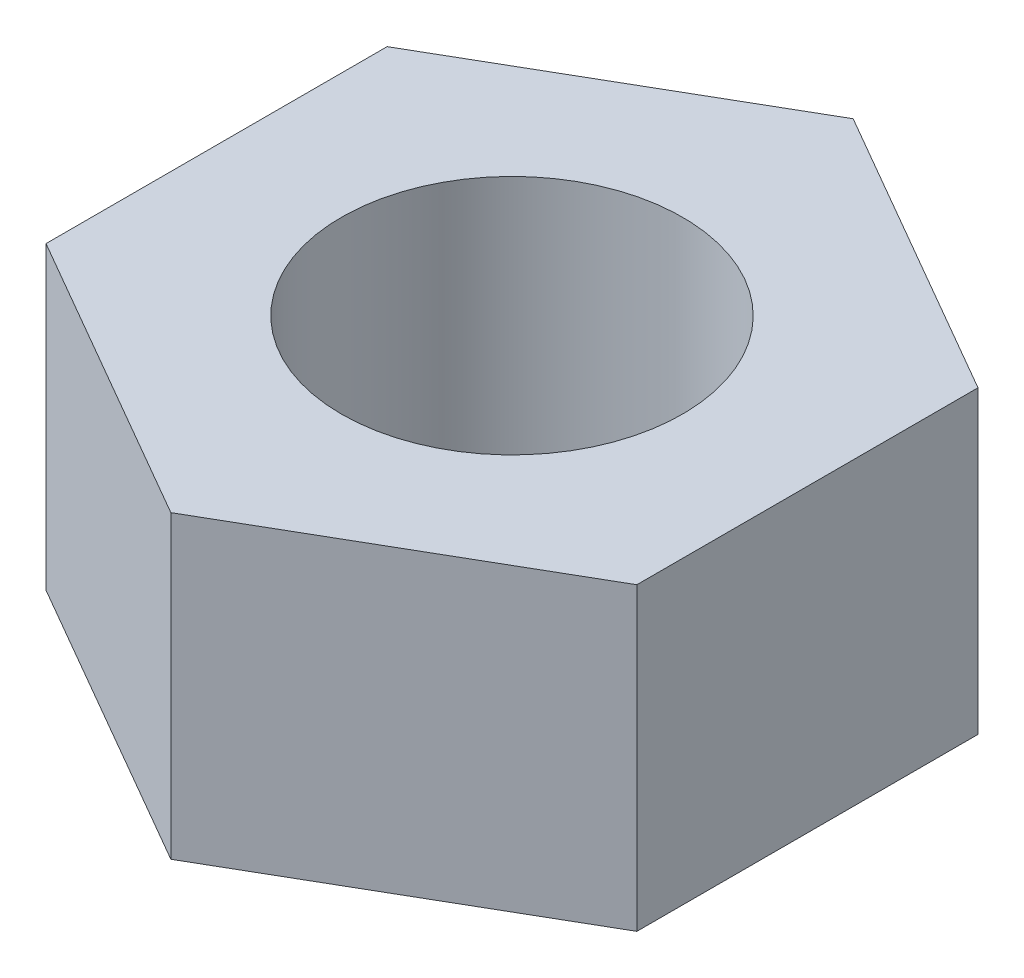
ISO-10303-21;
HEADER;
FILE_DESCRIPTION(('STEP AP214'),'2;1');
FILE_NAME('part.step','',(''),(''),'','','');
FILE_SCHEMA(('AUTOMOTIVE_DESIGN { 1 0 10303 214 1 1 1 1 }'));
ENDSEC;
DATA;
#1=APPLICATION_CONTEXT('core data for automotive mechanical design processes');
#2=APPLICATION_PROTOCOL_DEFINITION('international standard','automotive_design',2000,#1);
#3=PRODUCT_CONTEXT('',#1,'mechanical');
#4=PRODUCT('Part','Part','',(#3));
#5=PRODUCT_RELATED_PRODUCT_CATEGORY('part','',(#4));
#6=PRODUCT_DEFINITION_FORMATION('','',#4);
#7=PRODUCT_DEFINITION_CONTEXT('part definition',#1,'design');
#8=PRODUCT_DEFINITION('design','',#6,#7);
#9=PRODUCT_DEFINITION_SHAPE('','',#8);
#10=(LENGTH_UNIT() NAMED_UNIT(*) SI_UNIT(.MILLI.,.METRE.));
#11=(NAMED_UNIT(*) PLANE_ANGLE_UNIT() SI_UNIT($,.RADIAN.));
#12=(NAMED_UNIT(*) SI_UNIT($,.STERADIAN.) SOLID_ANGLE_UNIT());
#13=UNCERTAINTY_MEASURE_WITH_UNIT(LENGTH_MEASURE(1.E-05),#10,'distance_accuracy_value','');
#14=(GEOMETRIC_REPRESENTATION_CONTEXT(3) GLOBAL_UNCERTAINTY_ASSIGNED_CONTEXT((#13)) GLOBAL_UNIT_ASSIGNED_CONTEXT((#10,
#11,#12)) REPRESENTATION_CONTEXT('',''));
#15=CARTESIAN_POINT('',(0.,0.,0.));
#16=DIRECTION('',(0.,0.,1.));
#17=DIRECTION('',(1.,0.,0.));
#18=AXIS2_PLACEMENT_3D('',#15,#16,#17);
#19=CARTESIAN_POINT('',(0.,5.588,-6.34981373060135));
#20=DIRECTION('',(0.,1.,0.));
#21=DIRECTION('',(0.,0.,1.));
#22=AXIS2_PLACEMENT_3D('',#19,#20,#21);
#23=PLANE('',#22);
#24=DIRECTION('',(-0.866025403784438,0.,-0.5));
#25=VECTOR('',#24,1.);
#26=CARTESIAN_POINT('',(5.4991,5.588,-3.17490686530067));
#27=LINE('',#26,#25);
#28=CARTESIAN_POINT('',(5.4991,5.588,-3.17490686530067));
#29=VERTEX_POINT('',#28);
#30=CARTESIAN_POINT('',(0.,5.588,-6.34981373060135));
#31=VERTEX_POINT('',#30);
#32=EDGE_CURVE('E127',#29,#31,#27,.T.);
#33=ORIENTED_EDGE('',*,*,#32,.T.);
#34=DIRECTION('',(-0.866025403784439,0.,0.5));
#35=VECTOR('',#34,1.);
#36=CARTESIAN_POINT('',(0.,5.588,-6.34981373060135));
#37=LINE('',#36,#35);
#38=CARTESIAN_POINT('',(-5.4991,5.588,-3.17490686530067));
#39=VERTEX_POINT('',#38);
#40=EDGE_CURVE('E85',#31,#39,#37,.T.);
#41=ORIENTED_EDGE('',*,*,#40,.T.);
#42=DIRECTION('',(0.,0.,1.));
#43=VECTOR('',#42,1.);
#44=CARTESIAN_POINT('',(-5.4991,5.588,-3.17490686530067));
#45=LINE('',#44,#43);
#46=CARTESIAN_POINT('',(-5.4991,5.588,3.17490686530067));
#47=VERTEX_POINT('',#46);
#48=EDGE_CURVE('E98',#39,#47,#45,.T.);
#49=ORIENTED_EDGE('',*,*,#48,.T.);
#50=DIRECTION('',(0.866025403784438,0.,0.5));
#51=VECTOR('',#50,1.);
#52=CARTESIAN_POINT('',(-5.4991,5.588,3.17490686530067));
#53=LINE('',#52,#51);
#54=CARTESIAN_POINT('',(0.,5.588,6.34981373060135));
#55=VERTEX_POINT('',#54);
#56=EDGE_CURVE('E92',#47,#55,#53,.T.);
#57=ORIENTED_EDGE('',*,*,#56,.T.);
#58=DIRECTION('',(0.866025403784439,0.,-0.5));
#59=VECTOR('',#58,1.);
#60=CARTESIAN_POINT('',(0.,5.588,6.34981373060135));
#61=LINE('',#60,#59);
#62=CARTESIAN_POINT('',(5.4991,5.588,3.17490686530067));
#63=VERTEX_POINT('',#62);
#64=EDGE_CURVE('E96',#55,#63,#61,.T.);
#65=ORIENTED_EDGE('',*,*,#64,.T.);
#66=DIRECTION('',(0.,0.,-1.));
#67=VECTOR('',#66,1.);
#68=CARTESIAN_POINT('',(5.4991,5.588,3.17490686530067));
#69=LINE('',#68,#67);
#70=EDGE_CURVE('E48',#63,#29,#69,.T.);
#71=ORIENTED_EDGE('',*,*,#70,.T.);
#72=EDGE_LOOP('',(#33,#41,#49,#57,#65,#71));
#73=FACE_BOUND('',#72,.T.);
#74=CARTESIAN_POINT('',(0.,5.588,0.));
#75=DIRECTION('',(0.,1.,0.));
#76=DIRECTION('',(0.,0.,1.));
#77=AXIS2_PLACEMENT_3D('',#74,#75,#76);
#78=CIRCLE('',#77,3.175);
#79=CARTESIAN_POINT('',(0.,5.588,3.175));
#80=VERTEX_POINT('',#79);
#81=EDGE_CURVE('E120',#80,#80,#78,.T.);
#82=ORIENTED_EDGE('',*,*,#81,.F.);
#83=EDGE_LOOP('',(#82));
#84=FACE_BOUND('',#83,.T.);
#85=ADVANCED_FACE('F31',(#73,#84),#23,.T.);
#86=CARTESIAN_POINT('',(0.,0.,-6.34981373060135));
#87=DIRECTION('',(0.,1.,0.));
#88=DIRECTION('',(0.,0.,1.));
#89=AXIS2_PLACEMENT_3D('',#86,#87,#88);
#90=PLANE('',#89);
#91=DIRECTION('',(-0.866025403784438,0.,-0.5));
#92=VECTOR('',#91,1.);
#93=CARTESIAN_POINT('',(5.4991,0.,-3.17490686530067));
#94=LINE('',#93,#92);
#95=CARTESIAN_POINT('',(5.4991,0.,-3.17490686530067));
#96=VERTEX_POINT('',#95);
#97=CARTESIAN_POINT('',(0.,0.,-6.34981373060135));
#98=VERTEX_POINT('',#97);
#99=EDGE_CURVE('E116',#96,#98,#94,.T.);
#100=ORIENTED_EDGE('',*,*,#99,.F.);
#101=DIRECTION('',(0.,0.,-1.));
#102=VECTOR('',#101,1.);
#103=CARTESIAN_POINT('',(5.4991,0.,3.17490686530067));
#104=LINE('',#103,#102);
#105=CARTESIAN_POINT('',(5.4991,0.,3.17490686530067));
#106=VERTEX_POINT('',#105);
#107=EDGE_CURVE('E77',#106,#96,#104,.T.);
#108=ORIENTED_EDGE('',*,*,#107,.F.);
#109=DIRECTION('',(0.866025403784439,0.,-0.5));
#110=VECTOR('',#109,1.);
#111=CARTESIAN_POINT('',(0.,0.,6.34981373060135));
#112=LINE('',#111,#110);
#113=CARTESIAN_POINT('',(0.,0.,6.34981373060135));
#114=VERTEX_POINT('',#113);
#115=EDGE_CURVE('E71',#114,#106,#112,.T.);
#116=ORIENTED_EDGE('',*,*,#115,.F.);
#117=DIRECTION('',(0.866025403784438,0.,0.5));
#118=VECTOR('',#117,1.);
#119=CARTESIAN_POINT('',(-5.4991,0.,3.17490686530067));
#120=LINE('',#119,#118);
#121=CARTESIAN_POINT('',(-5.4991,0.,3.17490686530067));
#122=VERTEX_POINT('',#121);
#123=EDGE_CURVE('E106',#122,#114,#120,.T.);
#124=ORIENTED_EDGE('',*,*,#123,.F.);
#125=DIRECTION('',(0.,0.,1.));
#126=VECTOR('',#125,1.);
#127=CARTESIAN_POINT('',(-5.4991,0.,-3.17490686530067));
#128=LINE('',#127,#126);
#129=CARTESIAN_POINT('',(-5.4991,0.,-3.17490686530067));
#130=VERTEX_POINT('',#129);
#131=EDGE_CURVE('E122',#130,#122,#128,.T.);
#132=ORIENTED_EDGE('',*,*,#131,.F.);
#133=DIRECTION('',(-0.866025403784439,0.,0.5));
#134=VECTOR('',#133,1.);
#135=CARTESIAN_POINT('',(0.,0.,-6.34981373060135));
#136=LINE('',#135,#134);
#137=EDGE_CURVE('E119',#98,#130,#136,.T.);
#138=ORIENTED_EDGE('',*,*,#137,.F.);
#139=EDGE_LOOP('',(#100,#108,#116,#124,#132,#138));
#140=FACE_BOUND('',#139,.T.);
#141=CARTESIAN_POINT('',(0.,0.,0.));
#142=DIRECTION('',(0.,1.,0.));
#143=DIRECTION('',(0.,0.,1.));
#144=AXIS2_PLACEMENT_3D('',#141,#142,#143);
#145=CIRCLE('',#144,3.175);
#146=CARTESIAN_POINT('',(0.,0.,3.175));
#147=VERTEX_POINT('',#146);
#148=EDGE_CURVE('E220',#147,#147,#145,.T.);
#149=ORIENTED_EDGE('',*,*,#148,.T.);
#150=EDGE_LOOP('',(#149));
#151=FACE_BOUND('',#150,.T.);
#152=ADVANCED_FACE('F136',(#140,#151),#90,.F.);
#153=CARTESIAN_POINT('',(5.4991,5.588,-3.17490686530067));
#154=DIRECTION('',(-0.5,0.,0.866025403784439));
#155=DIRECTION('',(0.866025403784439,0.,0.5));
#156=AXIS2_PLACEMENT_3D('',#153,#154,#155);
#157=PLANE('',#156);
#158=ORIENTED_EDGE('',*,*,#99,.T.);
#159=DIRECTION('',(0.,-1.,0.));
#160=VECTOR('',#159,1.);
#161=CARTESIAN_POINT('',(0.,5.588,-6.34981373060135));
#162=LINE('',#161,#160);
#163=EDGE_CURVE('E11',#31,#98,#162,.T.);
#164=ORIENTED_EDGE('',*,*,#163,.F.);
#165=ORIENTED_EDGE('',*,*,#32,.F.);
#166=DIRECTION('',(0.,-1.,0.));
#167=VECTOR('',#166,1.);
#168=CARTESIAN_POINT('',(5.4991,5.588,-3.17490686530067));
#169=LINE('',#168,#167);
#170=EDGE_CURVE('E112',#29,#96,#169,.T.);
#171=ORIENTED_EDGE('',*,*,#170,.T.);
#172=EDGE_LOOP('',(#158,#164,#165,#171));
#173=FACE_BOUND('',#172,.T.);
#174=ADVANCED_FACE('F33',(#173),#157,.F.);
#175=CARTESIAN_POINT('',(0.,5.588,-6.34981373060135));
#176=DIRECTION('',(0.5,0.,0.866025403784439));
#177=DIRECTION('',(0.866025403784438,0.,-0.5));
#178=AXIS2_PLACEMENT_3D('',#175,#176,#177);
#179=PLANE('',#178);
#180=ORIENTED_EDGE('',*,*,#137,.T.);
#181=DIRECTION('',(0.,-1.,0.));
#182=VECTOR('',#181,1.);
#183=CARTESIAN_POINT('',(-5.4991,5.588,-3.17490686530067));
#184=LINE('',#183,#182);
#185=EDGE_CURVE('E40',#39,#130,#184,.T.);
#186=ORIENTED_EDGE('',*,*,#185,.F.);
#187=ORIENTED_EDGE('',*,*,#40,.F.);
#188=ORIENTED_EDGE('',*,*,#163,.T.);
#189=EDGE_LOOP('',(#180,#186,#187,#188));
#190=FACE_BOUND('',#189,.T.);
#191=ADVANCED_FACE('F161',(#190),#179,.F.);
#192=CARTESIAN_POINT('',(-5.4991,5.588,-3.17490686530067));
#193=DIRECTION('',(1.,0.,0.));
#194=DIRECTION('',(0.,0.,-1.));
#195=AXIS2_PLACEMENT_3D('',#192,#193,#194);
#196=PLANE('',#195);
#197=ORIENTED_EDGE('',*,*,#131,.T.);
#198=DIRECTION('',(0.,-1.,0.));
#199=VECTOR('',#198,1.);
#200=CARTESIAN_POINT('',(-5.4991,5.588,3.17490686530067));
#201=LINE('',#200,#199);
#202=EDGE_CURVE('E107',#47,#122,#201,.T.);
#203=ORIENTED_EDGE('',*,*,#202,.F.);
#204=ORIENTED_EDGE('',*,*,#48,.F.);
#205=ORIENTED_EDGE('',*,*,#185,.T.);
#206=EDGE_LOOP('',(#197,#203,#204,#205));
#207=FACE_BOUND('',#206,.T.);
#208=ADVANCED_FACE('F133',(#207),#196,.F.);
#209=CARTESIAN_POINT('',(-5.4991,5.588,3.17490686530067));
#210=DIRECTION('',(0.5,0.,-0.866025403784439));
#211=DIRECTION('',(-0.866025403784439,0.,-0.5));
#212=AXIS2_PLACEMENT_3D('',#209,#210,#211);
#213=PLANE('',#212);
#214=ORIENTED_EDGE('',*,*,#123,.T.);
#215=DIRECTION('',(0.,-1.,0.));
#216=VECTOR('',#215,1.);
#217=CARTESIAN_POINT('',(0.,5.588,6.34981373060135));
#218=LINE('',#217,#216);
#219=EDGE_CURVE('E103',#55,#114,#218,.T.);
#220=ORIENTED_EDGE('',*,*,#219,.F.);
#221=ORIENTED_EDGE('',*,*,#56,.F.);
#222=ORIENTED_EDGE('',*,*,#202,.T.);
#223=EDGE_LOOP('',(#214,#220,#221,#222));
#224=FACE_BOUND('',#223,.T.);
#225=ADVANCED_FACE('F104',(#224),#213,.F.);
#226=CARTESIAN_POINT('',(0.,5.588,6.34981373060135));
#227=DIRECTION('',(-0.5,0.,-0.866025403784439));
#228=DIRECTION('',(-0.866025403784439,0.,0.5));
#229=AXIS2_PLACEMENT_3D('',#226,#227,#228);
#230=PLANE('',#229);
#231=ORIENTED_EDGE('',*,*,#115,.T.);
#232=DIRECTION('',(0.,-1.,0.));
#233=VECTOR('',#232,1.);
#234=CARTESIAN_POINT('',(5.4991,5.588,3.17490686530067));
#235=LINE('',#234,#233);
#236=EDGE_CURVE('E108',#63,#106,#235,.T.);
#237=ORIENTED_EDGE('',*,*,#236,.F.);
#238=ORIENTED_EDGE('',*,*,#64,.F.);
#239=ORIENTED_EDGE('',*,*,#219,.T.);
#240=EDGE_LOOP('',(#231,#237,#238,#239));
#241=FACE_BOUND('',#240,.T.);
#242=ADVANCED_FACE('F110',(#241),#230,.F.);
#243=CARTESIAN_POINT('',(5.4991,5.588,3.17490686530067));
#244=DIRECTION('',(-1.,0.,0.));
#245=DIRECTION('',(0.,0.,1.));
#246=AXIS2_PLACEMENT_3D('',#243,#244,#245);
#247=PLANE('',#246);
#248=ORIENTED_EDGE('',*,*,#107,.T.);
#249=ORIENTED_EDGE('',*,*,#170,.F.);
#250=ORIENTED_EDGE('',*,*,#70,.F.);
#251=ORIENTED_EDGE('',*,*,#236,.T.);
#252=EDGE_LOOP('',(#248,#249,#250,#251));
#253=FACE_BOUND('',#252,.T.);
#254=ADVANCED_FACE('F141',(#253),#247,.F.);
#255=CARTESIAN_POINT('',(0.,5.588,0.));
#256=DIRECTION('',(0.,-1.,0.));
#257=DIRECTION('',(0.,0.,-1.));
#258=AXIS2_PLACEMENT_3D('',#255,#256,#257);
#259=CYLINDRICAL_SURFACE('',#258,3.175);
#260=ORIENTED_EDGE('',*,*,#81,.T.);
#261=EDGE_LOOP('',(#260));
#262=FACE_BOUND('',#261,.T.);
#263=ORIENTED_EDGE('',*,*,#148,.F.);
#264=EDGE_LOOP('',(#263));
#265=FACE_BOUND('',#264,.T.);
#266=ADVANCED_FACE('F143',(#262,#265),#259,.F.);
#267=CLOSED_SHELL('',(#85,#152,#174,#191,#208,#225,#242,#254,#266));
#268=MANIFOLD_SOLID_BREP('B2',#267);
#269=ADVANCED_BREP_SHAPE_REPRESENTATION('',(#18,#268),#14);
#270=SHAPE_DEFINITION_REPRESENTATION(#9,#269);
ENDSEC;
END-ISO-10303-21;
